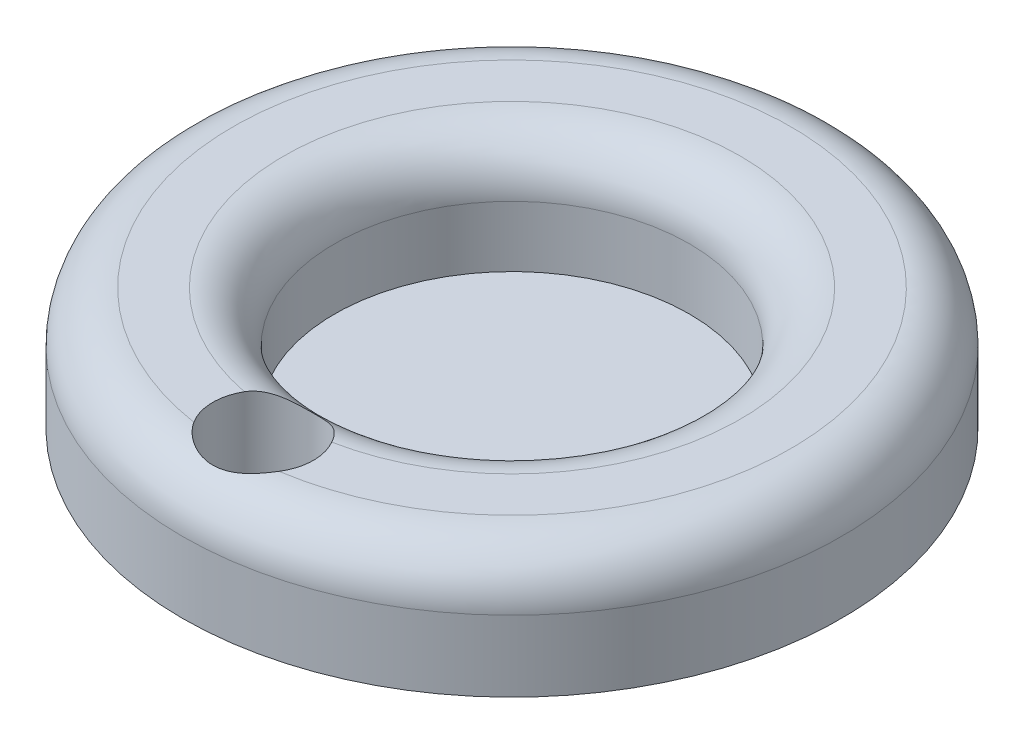
ISO-10303-21;
HEADER;
FILE_DESCRIPTION(('STEP AP214'),'2;1');
FILE_NAME('part.step','',(''),(''),'','','');
FILE_SCHEMA(('AUTOMOTIVE_DESIGN { 1 0 10303 214 1 1 1 1 }'));
ENDSEC;
DATA;
#1=APPLICATION_CONTEXT('core data for automotive mechanical design processes');
#2=APPLICATION_PROTOCOL_DEFINITION('international standard','automotive_design',2000,#1);
#3=PRODUCT_CONTEXT('',#1,'mechanical');
#4=PRODUCT('Part','Part','',(#3));
#5=PRODUCT_RELATED_PRODUCT_CATEGORY('part','',(#4));
#6=PRODUCT_DEFINITION_FORMATION('','',#4);
#7=PRODUCT_DEFINITION_CONTEXT('part definition',#1,'design');
#8=PRODUCT_DEFINITION('design','',#6,#7);
#9=PRODUCT_DEFINITION_SHAPE('','',#8);
#10=(LENGTH_UNIT() NAMED_UNIT(*) SI_UNIT(.MILLI.,.METRE.));
#11=(NAMED_UNIT(*) PLANE_ANGLE_UNIT() SI_UNIT($,.RADIAN.));
#12=(NAMED_UNIT(*) SI_UNIT($,.STERADIAN.) SOLID_ANGLE_UNIT());
#13=UNCERTAINTY_MEASURE_WITH_UNIT(LENGTH_MEASURE(1.E-05),#10,'distance_accuracy_value','');
#14=(GEOMETRIC_REPRESENTATION_CONTEXT(3) GLOBAL_UNCERTAINTY_ASSIGNED_CONTEXT((#13)) GLOBAL_UNIT_ASSIGNED_CONTEXT((#10,
#11,#12)) REPRESENTATION_CONTEXT('',''));
#15=CARTESIAN_POINT('',(0.,0.,0.));
#16=DIRECTION('',(0.,0.,1.));
#17=DIRECTION('',(1.,0.,0.));
#18=AXIS2_PLACEMENT_3D('',#15,#16,#17);
#19=CARTESIAN_POINT('',(0.,12.,24.54));
#20=DIRECTION('',(0.,-1.,0.));
#21=DIRECTION('',(0.,0.,-1.));
#22=AXIS2_PLACEMENT_3D('',#19,#20,#21);
#23=CYLINDRICAL_SURFACE('',#22,4.96);
#24=CARTESIAN_POINT('',(0.,12.,24.54));
#25=DIRECTION('',(0.,1.,0.));
#26=DIRECTION('',(0.,0.,1.));
#27=AXIS2_PLACEMENT_3D('',#24,#25,#26);
#28=CIRCLE('',#27,4.96);
#29=CARTESIAN_POINT('',(4.2007679275279,12.,27.1772616136919));
#30=VERTEX_POINT('',#29);
#31=CARTESIAN_POINT('',(4.30898943303839,12.,22.0835370823146));
#32=VERTEX_POINT('',#31);
#33=EDGE_CURVE('E71',#30,#32,#28,.T.);
#34=ORIENTED_EDGE('',*,*,#33,.T.);
#35=CARTESIAN_POINT('',(4.30898943303839,12.,22.0835370823146));
#36=CARTESIAN_POINT('',(4.24589902360054,12.0000354715586,21.9728040188073));
#37=CARTESIAN_POINT('',(4.17852618571755,11.9956272008137,21.8646002445173));
#38=CARTESIAN_POINT('',(4.03609583204233,11.9789477833624,21.6542501064274));
#39=CARTESIAN_POINT('',(3.96105068231352,11.9666891269369,21.5520944014595));
#40=CARTESIAN_POINT('',(3.80480908339857,11.9354985781781,21.3555621749559));
#41=CARTESIAN_POINT('',(3.72368881268749,11.9166410705394,21.2611128455515));
#42=CARTESIAN_POINT('',(3.55527128340381,11.8733715321086,21.0792180290172));
#43=CARTESIAN_POINT('',(3.46797171322311,11.8489574150025,20.9917751892971));
#44=CARTESIAN_POINT('',(3.28838525346751,11.7959484547017,20.8247517381094));
#45=CARTESIAN_POINT('',(3.19613214356673,11.7673801027398,20.7451262989144));
#46=CARTESIAN_POINT('',(3.0066865290619,11.7072123381079,20.5933337694372));
#47=CARTESIAN_POINT('',(2.90949449519929,11.6756132140548,20.5211659703299));
#48=CARTESIAN_POINT('',(2.61005206053511,11.5778262921603,20.3153000941507));
#49=CARTESIAN_POINT('',(2.40069593899733,11.5088925898569,20.192943352768));
#50=CARTESIAN_POINT('',(2.05701782355841,11.403169363469,20.0244664547842));
#51=CARTESIAN_POINT('',(1.92806868318739,11.365028146791,19.9678992927484));
#52=CARTESIAN_POINT('',(1.66482390586077,11.2924644550558,19.8656136533141));
#53=CARTESIAN_POINT('',(1.53052730956514,11.2580426514168,19.8198971328671));
#54=CARTESIAN_POINT('',(1.25771908086295,11.1955701685834,19.7400145047499));
#55=CARTESIAN_POINT('',(1.1192275622584,11.1674932904593,19.705800604745));
#56=CARTESIAN_POINT('',(0.838400121354456,11.1199578129473,19.6492781157341));
#57=CARTESIAN_POINT('',(0.6960664948888,11.1004941826271,19.6269625754224));
#58=CARTESIAN_POINT('',(0.446492198875491,11.0758127013058,19.598983694761));
#59=CARTESIAN_POINT('',(0.339796954135752,11.068201670824,19.5904931689449));
#60=CARTESIAN_POINT('',(0.125821664580021,11.0591741073085,19.5804403107348));
#61=CARTESIAN_POINT('',(0.0185417104054052,11.0577566400447,19.5788769334569));
#62=CARTESIAN_POINT('',(-0.195814585830387,11.0612078557247,19.5827071481936));
#63=CARTESIAN_POINT('',(-0.302890871852978,11.0660780718418,19.588102436992));
#64=CARTESIAN_POINT('',(-0.516030989057379,11.0818050591288,19.6057574170193));
#65=CARTESIAN_POINT('',(-0.622094745555585,11.0926622684777,19.6180176106814));
#66=CARTESIAN_POINT('',(-0.831852637590203,11.1196450695772,19.6491113794403));
#67=CARTESIAN_POINT('',(-0.935557650112243,11.1357361991337,19.6679020095295));
#68=CARTESIAN_POINT('',(-1.14082903588192,11.1723677572921,19.7118393167907));
#69=CARTESIAN_POINT('',(-1.2423945619248,11.1929099133995,19.7369884624253));
#70=CARTESIAN_POINT('',(-1.54347838051167,11.2598250628693,19.8216570885741));
#71=CARTESIAN_POINT('',(-1.7392850567187,11.3114723955528,19.8903827790751));
#72=CARTESIAN_POINT('',(-2.15546468404671,11.4313747770234,20.0660818512497));
#73=CARTESIAN_POINT('',(-2.37342031733241,11.500919832474,20.1778452494399));
#74=CARTESIAN_POINT('',(-2.79139778315271,11.6367853845541,20.4327359993821));
#75=CARTESIAN_POINT('',(-2.99141370639339,11.7031048154025,20.5758736326471));
#76=CARTESIAN_POINT('',(-3.35780446289372,11.817674894109,20.8821757029321));
#77=CARTESIAN_POINT('',(-3.52553891867434,11.8668432525276,21.0433351424676));
#78=CARTESIAN_POINT('',(-3.76015915012396,11.9251967490251,21.3032687868294));
#79=CARTESIAN_POINT('',(-3.83546897110196,11.9420722248341,21.392847363206));
#80=CARTESIAN_POINT('',(-3.97994577575555,11.9698206375254,21.5776770150353));
#81=CARTESIAN_POINT('',(-4.04911685187496,11.9806975989746,21.6729242395875));
#82=CARTESIAN_POINT('',(-4.14913271553,11.9920460757226,21.8215330893844));
#83=CARTESIAN_POINT('',(-4.1824454913065,11.9950061631742,21.8730696431006));
#84=CARTESIAN_POINT('',(-4.24716414983001,11.9989835473725,21.9773910561542));
#85=CARTESIAN_POINT('',(-4.27857024681001,12.0000010627778,22.0301757743193));
#86=CARTESIAN_POINT('',(-4.30898943303839,12.,22.0835370823146));
#87=B_SPLINE_CURVE_WITH_KNOTS('',3,(#35,#36,#37,#38,#39,#40,#41,#42,#43,#44,#45,#46,#47,#48,#49,
#50,#51,#52,#53,#54,#55,#56,#57,#58,#59,#60,#61,#62,#63,#64,#65,#66,#67,#68,#69,#70,#71,#72,#73,
#74,#75,#76,#77,#78,#79,#80,#81,#82,#83,#84,#85,#86),.UNSPECIFIED.,.F.,.F.,(4,2,2,2,2,2,2,2,2,2,
2,2,2,2,2,2,2,2,2,2,2,2,2,2,2,4),(0.,0.382049027198543,0.763491704067316,1.14076621554635,
1.51818261488207,1.89329000326238,2.26836170601561,3.02166980994722,3.45891180889575,
3.89623260616158,4.33171324711817,4.76693919034275,5.08847379934902,5.40995990675717,
5.73152441936015,6.05311246991286,6.3726245270121,6.69226081402537,7.33183354118494,
8.09313384733944,8.8546840098695,9.56480984868294,9.91916657960108,10.2732852727758,
10.4575328309778,10.6417596488016),.UNSPECIFIED.);
#88=CARTESIAN_POINT('',(-4.30898943303839,12.,22.0835370823146));
#89=VERTEX_POINT('',#88);
#90=EDGE_CURVE('E11',#32,#89,#87,.T.);
#91=ORIENTED_EDGE('',*,*,#90,.T.);
#92=CARTESIAN_POINT('',(-4.2007679275279,12.,27.1772616136919));
#93=VERTEX_POINT('',#92);
#94=EDGE_CURVE('E72',#89,#93,#28,.T.);
#95=ORIENTED_EDGE('',*,*,#94,.T.);
#96=CARTESIAN_POINT('',(-4.2007679275279,12.,27.1772616136919));
#97=CARTESIAN_POINT('',(-4.12831037677723,11.9999973050466,27.2927120581267));
#98=CARTESIAN_POINT('',(-4.05109462526528,11.9968165026034,27.4051034806126));
#99=CARTESIAN_POINT('',(-3.88789024105839,11.9853020144853,27.6229146251485));
#100=CARTESIAN_POINT('',(-3.80190867444151,11.9769724521989,27.7283398513726));
#101=CARTESIAN_POINT('',(-3.62203186639481,11.9563866887807,27.9312883221577));
#102=CARTESIAN_POINT('',(-3.52815774663949,11.9441407365433,28.0288313683073));
#103=CARTESIAN_POINT('',(-3.33298489818669,11.9168614803836,28.2157427022697));
#104=CARTESIAN_POINT('',(-3.23168472233701,11.9018276322925,28.3051093890461));
#105=CARTESIAN_POINT('',(-2.91815876985521,11.854286280538,28.559730560722));
#106=CARTESIAN_POINT('',(-2.69570964297365,11.8192568761924,28.7121779890596));
#107=CARTESIAN_POINT('',(-2.22873805395066,11.7506487780484,28.9792222967162));
#108=CARTESIAN_POINT('',(-1.98420172476234,11.7170710154713,29.0937951839073));
#109=CARTESIAN_POINT('',(-1.59990660906803,11.6724710552348,29.2369919731312));
#110=CARTESIAN_POINT('',(-1.46590813518456,11.6583371591874,29.2805266545863));
#111=CARTESIAN_POINT('',(-1.19443465501558,11.6331991473743,29.3560928448161));
#112=CARTESIAN_POINT('',(-1.05696095133856,11.6221938773155,29.388128597219));
#113=CARTESIAN_POINT('',(-0.779590916929237,11.603976745875,29.4403829421683));
#114=CARTESIAN_POINT('',(-0.639695447778169,11.5967635629262,29.4606056519104));
#115=CARTESIAN_POINT('',(-0.358536862649826,11.5865614401992,29.4890413658412));
#116=CARTESIAN_POINT('',(-0.21727382807104,11.5835722505435,29.4972550804435));
#117=CARTESIAN_POINT('',(0.0582313959518321,11.5820410312452,29.5014725304119));
#118=CARTESIAN_POINT('',(0.192463543050603,11.5832795905943,29.4980786561044));
#119=CARTESIAN_POINT('',(0.460163012213814,11.5896546932817,29.4804302509155));
#120=CARTESIAN_POINT('',(0.593630057964628,11.5947925652317,29.4661720182174));
#121=CARTESIAN_POINT('',(0.858742662023004,11.608685058008,29.4269321536498));
#122=CARTESIAN_POINT('',(0.990388838665425,11.6174384182835,29.4019542591036));
#123=CARTESIAN_POINT('',(1.25101583548604,11.6380803654819,29.3415081174572));
#124=CARTESIAN_POINT('',(1.37999566143532,11.6499700999415,29.3060360301628));
#125=CARTESIAN_POINT('',(1.75901408889837,11.6891577792976,29.1851279945694));
#126=CARTESIAN_POINT('',(2.00406392572155,11.7201515900309,29.0847584060735));
#127=CARTESIAN_POINT('',(2.47494934539485,11.7858585742557,28.8465036683112));
#128=CARTESIAN_POINT('',(2.70076240334554,11.820576003285,28.7085753120377));
#129=CARTESIAN_POINT('',(3.02758260902943,11.8708152187778,28.4712839898211));
#130=CARTESIAN_POINT('',(3.13745119494761,11.8877029020205,28.3841752904832));
#131=CARTESIAN_POINT('',(3.34958754052659,11.9192122281695,28.2008049535823));
#132=CARTESIAN_POINT('',(3.45185849526022,11.9338348264639,28.1045472027848));
#133=CARTESIAN_POINT('',(3.64781648902596,11.9595321559037,27.9037292930075));
#134=CARTESIAN_POINT('',(3.74152535716591,11.9706160998901,27.7991915922635));
#135=CARTESIAN_POINT('',(3.9198666884698,11.9879872592554,27.5823536127082));
#136=CARTESIAN_POINT('',(4.00450696531295,11.9942786330394,27.4700601558895));
#137=CARTESIAN_POINT('',(4.10428600911117,11.9983302733336,27.3252627708957));
#138=CARTESIAN_POINT('',(4.12402980393405,11.9989513646529,27.2959443286624));
#139=CARTESIAN_POINT('',(4.16287719138761,11.9997860519157,27.2369056099636));
#140=CARTESIAN_POINT('',(4.18198115730003,11.9999998896712,27.2071855825095));
#141=CARTESIAN_POINT('',(4.2007679275279,12.,27.1772616136919));
#142=B_SPLINE_CURVE_WITH_KNOTS('',3,(#96,#97,#98,#99,#100,#101,#102,#103,#104,#105,#106,#107,
#108,#109,#110,#111,#112,#113,#114,#115,#116,#117,#118,#119,#120,#121,#122,#123,#124,#125,#126,
#127,#128,#129,#130,#131,#132,#133,#134,#135,#136,#137,#138,#139,#140,#141),.UNSPECIFIED.,.F.,
.F.,(4,2,2,2,2,2,2,2,2,2,2,2,2,2,2,2,2,2,2,2,2,2,4),(0.,0.408670548998448,0.817014237121825,
1.22429794678003,1.6316612379016,2.44371146670086,3.25627511807752,3.6806139529034,
4.10479602598837,4.52883017069648,4.95283922988767,5.35518485231055,5.75766762743836,
6.16001019405202,6.56250017445844,7.35867781990197,8.15577527325366,8.57901141553389,
9.00206855248922,9.4240151097876,9.84559513524139,9.95164501483061,10.0576319062992),.UNSPECIFIED.);
#143=EDGE_CURVE('E68',#93,#30,#142,.T.);
#144=ORIENTED_EDGE('',*,*,#143,.T.);
#145=EDGE_LOOP('',(#34,#91,#95,#144));
#146=FACE_BOUND('',#145,.T.);
#147=CARTESIAN_POINT('',(0.,0.,24.54));
#148=DIRECTION('',(0.,1.,0.));
#149=DIRECTION('',(0.,0.,1.));
#150=AXIS2_PLACEMENT_3D('',#147,#148,#149);
#151=CIRCLE('',#150,4.96);
#152=CARTESIAN_POINT('',(0.,0.,29.5));
#153=VERTEX_POINT('',#152);
#154=EDGE_CURVE('E134',#153,#153,#151,.T.);
#155=ORIENTED_EDGE('',*,*,#154,.F.);
#156=EDGE_LOOP('',(#155));
#157=FACE_BOUND('',#156,.T.);
#158=ADVANCED_FACE('F39',(#146,#157),#23,.F.);
#159=CARTESIAN_POINT('',(0.,12.,0.));
#160=DIRECTION('',(0.,-1.,0.));
#161=DIRECTION('',(0.,0.,-1.));
#162=AXIS2_PLACEMENT_3D('',#159,#160,#161);
#163=CYLINDRICAL_SURFACE('',#162,32.5);
#164=CARTESIAN_POINT('',(0.,7.,0.));
#165=DIRECTION('',(0.,1.,0.));
#166=DIRECTION('',(0.,0.,1.));
#167=AXIS2_PLACEMENT_3D('',#164,#165,#166);
#168=CIRCLE('',#167,32.5);
#169=CARTESIAN_POINT('',(0.,7.,32.5));
#170=VERTEX_POINT('',#169);
#171=EDGE_CURVE('E76',#170,#170,#168,.F.);
#172=ORIENTED_EDGE('',*,*,#171,.T.);
#173=EDGE_LOOP('',(#172));
#174=FACE_BOUND('',#173,.T.);
#175=CARTESIAN_POINT('',(0.,0.,0.));
#176=DIRECTION('',(0.,1.,0.));
#177=DIRECTION('',(0.,0.,1.));
#178=AXIS2_PLACEMENT_3D('',#175,#176,#177);
#179=CIRCLE('',#178,32.5);
#180=CARTESIAN_POINT('',(0.,0.,32.5));
#181=VERTEX_POINT('',#180);
#182=EDGE_CURVE('E85',#181,#181,#179,.T.);
#183=ORIENTED_EDGE('',*,*,#182,.T.);
#184=EDGE_LOOP('',(#183));
#185=FACE_BOUND('',#184,.T.);
#186=ADVANCED_FACE('F107',(#174,#185),#163,.T.);
#187=CARTESIAN_POINT('',(0.,12.,0.));
#188=DIRECTION('',(0.,1.,0.));
#189=DIRECTION('',(0.,0.,1.));
#190=AXIS2_PLACEMENT_3D('',#187,#188,#189);
#191=PLANE('',#190);
#192=ORIENTED_EDGE('',*,*,#94,.F.);
#193=CARTESIAN_POINT('',(0.,12.,0.));
#194=DIRECTION('',(0.,1.,0.));
#195=DIRECTION('',(0.,0.,1.));
#196=AXIS2_PLACEMENT_3D('',#193,#194,#195);
#197=CIRCLE('',#196,22.5);
#198=EDGE_CURVE('E52',#89,#32,#197,.F.);
#199=ORIENTED_EDGE('',*,*,#198,.T.);
#200=ORIENTED_EDGE('',*,*,#33,.F.);
#201=CARTESIAN_POINT('',(0.,12.,0.));
#202=DIRECTION('',(0.,1.,0.));
#203=DIRECTION('',(0.,0.,1.));
#204=AXIS2_PLACEMENT_3D('',#201,#202,#203);
#205=CIRCLE('',#204,27.5);
#206=EDGE_CURVE('E77',#30,#93,#205,.T.);
#207=ORIENTED_EDGE('',*,*,#206,.T.);
#208=EDGE_LOOP('',(#192,#199,#200,#207));
#209=FACE_BOUND('',#208,.T.);
#210=ADVANCED_FACE('F80',(#209),#191,.T.);
#211=CARTESIAN_POINT('',(0.,0.,0.));
#212=DIRECTION('',(0.,1.,0.));
#213=DIRECTION('',(0.,0.,1.));
#214=AXIS2_PLACEMENT_3D('',#211,#212,#213);
#215=PLANE('',#214);
#216=ORIENTED_EDGE('',*,*,#154,.T.);
#217=EDGE_LOOP('',(#216));
#218=FACE_BOUND('',#217,.T.);
#219=ORIENTED_EDGE('',*,*,#182,.F.);
#220=EDGE_LOOP('',(#219));
#221=FACE_BOUND('',#220,.T.);
#222=ADVANCED_FACE('F115',(#218,#221),#215,.F.);
#223=CARTESIAN_POINT('',(0.,1.,0.));
#224=DIRECTION('',(0.,1.,0.));
#225=DIRECTION('',(0.,0.,1.));
#226=AXIS2_PLACEMENT_3D('',#223,#224,#225);
#227=CYLINDRICAL_SURFACE('',#226,17.5);
#228=CARTESIAN_POINT('',(0.,7.,0.));
#229=DIRECTION('',(0.,1.,0.));
#230=DIRECTION('',(0.,0.,1.));
#231=AXIS2_PLACEMENT_3D('',#228,#229,#230);
#232=CIRCLE('',#231,17.5);
#233=CARTESIAN_POINT('',(0.,7.,17.5));
#234=VERTEX_POINT('',#233);
#235=EDGE_CURVE('E130',#234,#234,#232,.T.);
#236=ORIENTED_EDGE('',*,*,#235,.T.);
#237=EDGE_LOOP('',(#236));
#238=FACE_BOUND('',#237,.T.);
#239=CARTESIAN_POINT('',(0.,1.,0.));
#240=DIRECTION('',(0.,1.,0.));
#241=DIRECTION('',(0.,0.,1.));
#242=AXIS2_PLACEMENT_3D('',#239,#240,#241);
#243=CIRCLE('',#242,17.5);
#244=CARTESIAN_POINT('',(0.,1.,17.5));
#245=VERTEX_POINT('',#244);
#246=EDGE_CURVE('E133',#245,#245,#243,.T.);
#247=ORIENTED_EDGE('',*,*,#246,.F.);
#248=EDGE_LOOP('',(#247));
#249=FACE_BOUND('',#248,.T.);
#250=ADVANCED_FACE('F102',(#238,#249),#227,.F.);
#251=CARTESIAN_POINT('',(0.,1.,0.));
#252=DIRECTION('',(0.,1.,0.));
#253=DIRECTION('',(0.,0.,1.));
#254=AXIS2_PLACEMENT_3D('',#251,#252,#253);
#255=PLANE('',#254);
#256=ORIENTED_EDGE('',*,*,#246,.T.);
#257=EDGE_LOOP('',(#256));
#258=FACE_BOUND('',#257,.T.);
#259=ADVANCED_FACE('F96',(#258),#255,.T.);
#260=CARTESIAN_POINT('',(0.,7.,0.));
#261=DIRECTION('',(0.,1.,0.));
#262=DIRECTION('',(0.,0.,1.));
#263=AXIS2_PLACEMENT_3D('',#260,#261,#262);
#264=TOROIDAL_SURFACE('',#263,27.5,5.);
#265=ORIENTED_EDGE('',*,*,#171,.F.);
#266=EDGE_LOOP('',(#265));
#267=FACE_BOUND('',#266,.T.);
#268=ORIENTED_EDGE('',*,*,#143,.F.);
#269=ORIENTED_EDGE('',*,*,#206,.F.);
#270=EDGE_LOOP('',(#268,#269));
#271=FACE_BOUND('',#270,.T.);
#272=ADVANCED_FACE('F82',(#267,#271),#264,.T.);
#273=CARTESIAN_POINT('',(0.,7.,0.));
#274=DIRECTION('',(0.,1.,0.));
#275=DIRECTION('',(0.,0.,1.));
#276=AXIS2_PLACEMENT_3D('',#273,#274,#275);
#277=TOROIDAL_SURFACE('',#276,22.5,5.);
#278=ORIENTED_EDGE('',*,*,#90,.F.);
#279=ORIENTED_EDGE('',*,*,#198,.F.);
#280=EDGE_LOOP('',(#278,#279));
#281=FACE_BOUND('',#280,.T.);
#282=ORIENTED_EDGE('',*,*,#235,.F.);
#283=EDGE_LOOP('',(#282));
#284=FACE_BOUND('',#283,.T.);
#285=ADVANCED_FACE('F41',(#281,#284),#277,.T.);
#286=CLOSED_SHELL('',(#158,#186,#210,#222,#250,#259,#272,#285));
#287=MANIFOLD_SOLID_BREP('B2',#286);
#288=ADVANCED_BREP_SHAPE_REPRESENTATION('',(#18,#287),#14);
#289=SHAPE_DEFINITION_REPRESENTATION(#9,#288);
ENDSEC;
END-ISO-10303-21;
